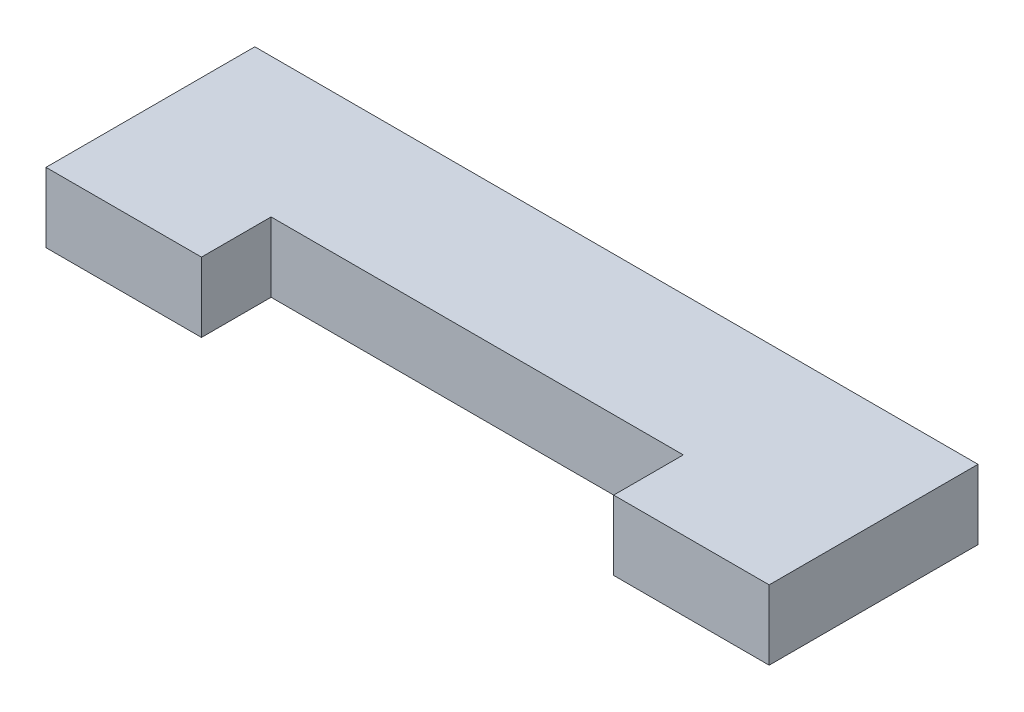
ISO-10303-21;
HEADER;
FILE_DESCRIPTION(('STEP AP214'),'2;1');
FILE_NAME('part.step','',(''),(''),'','','');
FILE_SCHEMA(('AUTOMOTIVE_DESIGN { 1 0 10303 214 1 1 1 1 }'));
ENDSEC;
DATA;
#1=APPLICATION_CONTEXT('core data for automotive mechanical design processes');
#2=APPLICATION_PROTOCOL_DEFINITION('international standard','automotive_design',2000,#1);
#3=PRODUCT_CONTEXT('',#1,'mechanical');
#4=PRODUCT('Part','Part','',(#3));
#5=PRODUCT_RELATED_PRODUCT_CATEGORY('part','',(#4));
#6=PRODUCT_DEFINITION_FORMATION('','',#4);
#7=PRODUCT_DEFINITION_CONTEXT('part definition',#1,'design');
#8=PRODUCT_DEFINITION('design','',#6,#7);
#9=PRODUCT_DEFINITION_SHAPE('','',#8);
#10=(LENGTH_UNIT() NAMED_UNIT(*) SI_UNIT(.MILLI.,.METRE.));
#11=(NAMED_UNIT(*) PLANE_ANGLE_UNIT() SI_UNIT($,.RADIAN.));
#12=(NAMED_UNIT(*) SI_UNIT($,.STERADIAN.) SOLID_ANGLE_UNIT());
#13=UNCERTAINTY_MEASURE_WITH_UNIT(LENGTH_MEASURE(1.E-05),#10,'distance_accuracy_value','');
#14=(GEOMETRIC_REPRESENTATION_CONTEXT(3) GLOBAL_UNCERTAINTY_ASSIGNED_CONTEXT((#13)) GLOBAL_UNIT_ASSIGNED_CONTEXT((#10,
#11,#12)) REPRESENTATION_CONTEXT('',''));
#15=CARTESIAN_POINT('',(0.,0.,0.));
#16=DIRECTION('',(0.,0.,1.));
#17=DIRECTION('',(1.,0.,0.));
#18=AXIS2_PLACEMENT_3D('',#15,#16,#17);
#19=CARTESIAN_POINT('',(-20.,3.85,-3.85));
#20=DIRECTION('',(0.,0.,1.));
#21=DIRECTION('',(1.,0.,0.));
#22=AXIS2_PLACEMENT_3D('',#19,#20,#21);
#23=PLANE('',#22);
#24=DIRECTION('',(-1.,0.,0.));
#25=VECTOR('',#24,1.);
#26=CARTESIAN_POINT('',(-20.,0.,-3.85));
#27=LINE('',#26,#25);
#28=CARTESIAN_POINT('',(20.,0.,-3.85));
#29=VERTEX_POINT('',#28);
#30=CARTESIAN_POINT('',(-20.,0.,-3.85));
#31=VERTEX_POINT('',#30);
#32=EDGE_CURVE('E187',#29,#31,#27,.T.);
#33=ORIENTED_EDGE('',*,*,#32,.T.);
#34=DIRECTION('',(0.,-1.,0.));
#35=VECTOR('',#34,1.);
#36=CARTESIAN_POINT('',(-20.,3.85,-3.85));
#37=LINE('',#36,#35);
#38=CARTESIAN_POINT('',(-20.,3.85,-3.85));
#39=VERTEX_POINT('',#38);
#40=EDGE_CURVE('E46',#39,#31,#37,.T.);
#41=ORIENTED_EDGE('',*,*,#40,.F.);
#42=DIRECTION('',(-1.,0.,0.));
#43=VECTOR('',#42,1.);
#44=CARTESIAN_POINT('',(-20.,3.85,-3.85));
#45=LINE('',#44,#43);
#46=CARTESIAN_POINT('',(20.,3.85,-3.85));
#47=VERTEX_POINT('',#46);
#48=EDGE_CURVE('E98',#47,#39,#45,.T.);
#49=ORIENTED_EDGE('',*,*,#48,.F.);
#50=DIRECTION('',(0.,-1.,0.));
#51=VECTOR('',#50,1.);
#52=CARTESIAN_POINT('',(20.,3.85,-3.85));
#53=LINE('',#52,#51);
#54=EDGE_CURVE('E12',#47,#29,#53,.T.);
#55=ORIENTED_EDGE('',*,*,#54,.T.);
#56=EDGE_LOOP('',(#33,#41,#49,#55));
#57=FACE_BOUND('',#56,.T.);
#58=ADVANCED_FACE('F38',(#57),#23,.F.);
#59=CARTESIAN_POINT('',(-20.,3.85,3.85));
#60=DIRECTION('',(1.,0.,0.));
#61=DIRECTION('',(0.,0.,-1.));
#62=AXIS2_PLACEMENT_3D('',#59,#60,#61);
#63=PLANE('',#62);
#64=DIRECTION('',(0.,0.,1.));
#65=VECTOR('',#64,1.);
#66=CARTESIAN_POINT('',(-20.,0.,3.85));
#67=LINE('',#66,#65);
#68=CARTESIAN_POINT('',(-20.,0.,7.7));
#69=VERTEX_POINT('',#68);
#70=EDGE_CURVE('E185',#31,#69,#67,.T.);
#71=ORIENTED_EDGE('',*,*,#70,.T.);
#72=DIRECTION('',(0.,-1.,0.));
#73=VECTOR('',#72,1.);
#74=CARTESIAN_POINT('',(-20.,3.85,7.7));
#75=LINE('',#74,#73);
#76=CARTESIAN_POINT('',(-20.,3.85,7.7));
#77=VERTEX_POINT('',#76);
#78=EDGE_CURVE('E178',#77,#69,#75,.T.);
#79=ORIENTED_EDGE('',*,*,#78,.F.);
#80=DIRECTION('',(0.,0.,1.));
#81=VECTOR('',#80,1.);
#82=CARTESIAN_POINT('',(-20.,3.85,3.85));
#83=LINE('',#82,#81);
#84=EDGE_CURVE('E154',#39,#77,#83,.T.);
#85=ORIENTED_EDGE('',*,*,#84,.F.);
#86=ORIENTED_EDGE('',*,*,#40,.T.);
#87=EDGE_LOOP('',(#71,#79,#85,#86));
#88=FACE_BOUND('',#87,.T.);
#89=ADVANCED_FACE('F183',(#88),#63,.F.);
#90=CARTESIAN_POINT('',(-20.,3.85,7.7));
#91=DIRECTION('',(0.,0.,-1.));
#92=DIRECTION('',(-1.,0.,0.));
#93=AXIS2_PLACEMENT_3D('',#90,#91,#92);
#94=PLANE('',#93);
#95=DIRECTION('',(1.,0.,0.));
#96=VECTOR('',#95,1.);
#97=CARTESIAN_POINT('',(-20.,0.,7.7));
#98=LINE('',#97,#96);
#99=CARTESIAN_POINT('',(-11.4,0.,7.7));
#100=VERTEX_POINT('',#99);
#101=EDGE_CURVE('E189',#69,#100,#98,.T.);
#102=ORIENTED_EDGE('',*,*,#101,.T.);
#103=DIRECTION('',(0.,-1.,0.));
#104=VECTOR('',#103,1.);
#105=CARTESIAN_POINT('',(-11.4,3.85,7.7));
#106=LINE('',#105,#104);
#107=CARTESIAN_POINT('',(-11.4,3.85,7.7));
#108=VERTEX_POINT('',#107);
#109=EDGE_CURVE('E175',#108,#100,#106,.T.);
#110=ORIENTED_EDGE('',*,*,#109,.F.);
#111=DIRECTION('',(1.,0.,0.));
#112=VECTOR('',#111,1.);
#113=CARTESIAN_POINT('',(-20.,3.85,7.7));
#114=LINE('',#113,#112);
#115=EDGE_CURVE('E150',#77,#108,#114,.T.);
#116=ORIENTED_EDGE('',*,*,#115,.F.);
#117=ORIENTED_EDGE('',*,*,#78,.T.);
#118=EDGE_LOOP('',(#102,#110,#116,#117));
#119=FACE_BOUND('',#118,.T.);
#120=ADVANCED_FACE('F213',(#119),#94,.F.);
#121=CARTESIAN_POINT('',(-11.4,3.85,7.7));
#122=DIRECTION('',(-1.,0.,0.));
#123=DIRECTION('',(0.,0.,1.));
#124=AXIS2_PLACEMENT_3D('',#121,#122,#123);
#125=PLANE('',#124);
#126=DIRECTION('',(0.,0.,-1.));
#127=VECTOR('',#126,1.);
#128=CARTESIAN_POINT('',(-11.4,0.,7.7));
#129=LINE('',#128,#127);
#130=CARTESIAN_POINT('',(-11.4,0.,3.85));
#131=VERTEX_POINT('',#130);
#132=EDGE_CURVE('E193',#100,#131,#129,.T.);
#133=ORIENTED_EDGE('',*,*,#132,.T.);
#134=DIRECTION('',(0.,-1.,0.));
#135=VECTOR('',#134,1.);
#136=CARTESIAN_POINT('',(-11.4,3.85,3.85));
#137=LINE('',#136,#135);
#138=CARTESIAN_POINT('',(-11.4,3.85,3.85));
#139=VERTEX_POINT('',#138);
#140=EDGE_CURVE('E128',#139,#131,#137,.T.);
#141=ORIENTED_EDGE('',*,*,#140,.F.);
#142=DIRECTION('',(0.,0.,-1.));
#143=VECTOR('',#142,1.);
#144=CARTESIAN_POINT('',(-11.4,3.85,7.7));
#145=LINE('',#144,#143);
#146=EDGE_CURVE('E118',#108,#139,#145,.T.);
#147=ORIENTED_EDGE('',*,*,#146,.F.);
#148=ORIENTED_EDGE('',*,*,#109,.T.);
#149=EDGE_LOOP('',(#133,#141,#147,#148));
#150=FACE_BOUND('',#149,.T.);
#151=ADVANCED_FACE('F197',(#150),#125,.F.);
#152=CARTESIAN_POINT('',(-11.4,3.85,3.85));
#153=DIRECTION('',(0.,0.,-1.));
#154=DIRECTION('',(-1.,0.,0.));
#155=AXIS2_PLACEMENT_3D('',#152,#153,#154);
#156=PLANE('',#155);
#157=DIRECTION('',(1.,0.,0.));
#158=VECTOR('',#157,1.);
#159=CARTESIAN_POINT('',(-11.4,0.,3.85));
#160=LINE('',#159,#158);
#161=CARTESIAN_POINT('',(11.4,0.,3.85));
#162=VERTEX_POINT('',#161);
#163=EDGE_CURVE('E127',#131,#162,#160,.T.);
#164=ORIENTED_EDGE('',*,*,#163,.T.);
#165=DIRECTION('',(0.,-1.,0.));
#166=VECTOR('',#165,1.);
#167=CARTESIAN_POINT('',(11.4,3.85,3.85));
#168=LINE('',#167,#166);
#169=CARTESIAN_POINT('',(11.4,3.85,3.85));
#170=VERTEX_POINT('',#169);
#171=EDGE_CURVE('E124',#170,#162,#168,.T.);
#172=ORIENTED_EDGE('',*,*,#171,.F.);
#173=DIRECTION('',(1.,0.,0.));
#174=VECTOR('',#173,1.);
#175=CARTESIAN_POINT('',(-11.4,3.85,3.85));
#176=LINE('',#175,#174);
#177=EDGE_CURVE('E112',#139,#170,#176,.T.);
#178=ORIENTED_EDGE('',*,*,#177,.F.);
#179=ORIENTED_EDGE('',*,*,#140,.T.);
#180=EDGE_LOOP('',(#164,#172,#178,#179));
#181=FACE_BOUND('',#180,.T.);
#182=ADVANCED_FACE('F125',(#181),#156,.F.);
#183=CARTESIAN_POINT('',(11.4,3.85,7.7));
#184=DIRECTION('',(1.,0.,0.));
#185=DIRECTION('',(0.,0.,-1.));
#186=AXIS2_PLACEMENT_3D('',#183,#184,#185);
#187=PLANE('',#186);
#188=DIRECTION('',(0.,0.,1.));
#189=VECTOR('',#188,1.);
#190=CARTESIAN_POINT('',(11.4,0.,7.7));
#191=LINE('',#190,#189);
#192=CARTESIAN_POINT('',(11.4,0.,7.7));
#193=VERTEX_POINT('',#192);
#194=EDGE_CURVE('E84',#162,#193,#191,.T.);
#195=ORIENTED_EDGE('',*,*,#194,.T.);
#196=DIRECTION('',(0.,-1.,0.));
#197=VECTOR('',#196,1.);
#198=CARTESIAN_POINT('',(11.4,3.85,7.7));
#199=LINE('',#198,#197);
#200=CARTESIAN_POINT('',(11.4,3.85,7.7));
#201=VERTEX_POINT('',#200);
#202=EDGE_CURVE('E129',#201,#193,#199,.T.);
#203=ORIENTED_EDGE('',*,*,#202,.F.);
#204=DIRECTION('',(0.,0.,1.));
#205=VECTOR('',#204,1.);
#206=CARTESIAN_POINT('',(11.4,3.85,7.7));
#207=LINE('',#206,#205);
#208=EDGE_CURVE('E116',#170,#201,#207,.T.);
#209=ORIENTED_EDGE('',*,*,#208,.F.);
#210=ORIENTED_EDGE('',*,*,#171,.T.);
#211=EDGE_LOOP('',(#195,#203,#209,#210));
#212=FACE_BOUND('',#211,.T.);
#213=ADVANCED_FACE('F131',(#212),#187,.F.);
#214=CARTESIAN_POINT('',(20.,3.85,7.7));
#215=DIRECTION('',(0.,0.,-1.));
#216=DIRECTION('',(-1.,0.,0.));
#217=AXIS2_PLACEMENT_3D('',#214,#215,#216);
#218=PLANE('',#217);
#219=DIRECTION('',(1.,0.,0.));
#220=VECTOR('',#219,1.);
#221=CARTESIAN_POINT('',(20.,0.,7.7));
#222=LINE('',#221,#220);
#223=CARTESIAN_POINT('',(20.,0.,7.7));
#224=VERTEX_POINT('',#223);
#225=EDGE_CURVE('E91',#193,#224,#222,.T.);
#226=ORIENTED_EDGE('',*,*,#225,.T.);
#227=DIRECTION('',(0.,-1.,0.));
#228=VECTOR('',#227,1.);
#229=CARTESIAN_POINT('',(20.,3.85,7.7));
#230=LINE('',#229,#228);
#231=CARTESIAN_POINT('',(20.,3.85,7.7));
#232=VERTEX_POINT('',#231);
#233=EDGE_CURVE('E137',#232,#224,#230,.T.);
#234=ORIENTED_EDGE('',*,*,#233,.F.);
#235=DIRECTION('',(1.,0.,0.));
#236=VECTOR('',#235,1.);
#237=CARTESIAN_POINT('',(20.,3.85,7.7));
#238=LINE('',#237,#236);
#239=EDGE_CURVE('E134',#201,#232,#238,.T.);
#240=ORIENTED_EDGE('',*,*,#239,.F.);
#241=ORIENTED_EDGE('',*,*,#202,.T.);
#242=EDGE_LOOP('',(#226,#234,#240,#241));
#243=FACE_BOUND('',#242,.T.);
#244=ADVANCED_FACE('F226',(#243),#218,.F.);
#245=CARTESIAN_POINT('',(20.,3.85,3.85));
#246=DIRECTION('',(-1.,0.,0.));
#247=DIRECTION('',(0.,0.,1.));
#248=AXIS2_PLACEMENT_3D('',#245,#246,#247);
#249=PLANE('',#248);
#250=DIRECTION('',(0.,0.,-1.));
#251=VECTOR('',#250,1.);
#252=CARTESIAN_POINT('',(20.,0.,3.85));
#253=LINE('',#252,#251);
#254=EDGE_CURVE('E164',#224,#29,#253,.T.);
#255=ORIENTED_EDGE('',*,*,#254,.T.);
#256=ORIENTED_EDGE('',*,*,#54,.F.);
#257=DIRECTION('',(0.,0.,-1.));
#258=VECTOR('',#257,1.);
#259=CARTESIAN_POINT('',(20.,3.85,3.85));
#260=LINE('',#259,#258);
#261=EDGE_CURVE('E54',#232,#47,#260,.T.);
#262=ORIENTED_EDGE('',*,*,#261,.F.);
#263=ORIENTED_EDGE('',*,*,#233,.T.);
#264=EDGE_LOOP('',(#255,#256,#262,#263));
#265=FACE_BOUND('',#264,.T.);
#266=ADVANCED_FACE('F206',(#265),#249,.F.);
#267=CARTESIAN_POINT('',(0.,3.85,0.));
#268=DIRECTION('',(0.,-1.,0.));
#269=DIRECTION('',(0.,0.,-1.));
#270=AXIS2_PLACEMENT_3D('',#267,#268,#269);
#271=PLANE('',#270);
#272=ORIENTED_EDGE('',*,*,#261,.T.);
#273=ORIENTED_EDGE('',*,*,#48,.T.);
#274=ORIENTED_EDGE('',*,*,#84,.T.);
#275=ORIENTED_EDGE('',*,*,#115,.T.);
#276=ORIENTED_EDGE('',*,*,#146,.T.);
#277=ORIENTED_EDGE('',*,*,#177,.T.);
#278=ORIENTED_EDGE('',*,*,#208,.T.);
#279=ORIENTED_EDGE('',*,*,#239,.T.);
#280=EDGE_LOOP('',(#272,#273,#274,#275,#276,#277,#278,#279));
#281=FACE_BOUND('',#280,.T.);
#282=ADVANCED_FACE('F114',(#281),#271,.F.);
#283=CARTESIAN_POINT('',(0.,0.,0.));
#284=DIRECTION('',(0.,-1.,0.));
#285=DIRECTION('',(0.,0.,-1.));
#286=AXIS2_PLACEMENT_3D('',#283,#284,#285);
#287=PLANE('',#286);
#288=ORIENTED_EDGE('',*,*,#32,.F.);
#289=ORIENTED_EDGE('',*,*,#254,.F.);
#290=ORIENTED_EDGE('',*,*,#225,.F.);
#291=ORIENTED_EDGE('',*,*,#194,.F.);
#292=ORIENTED_EDGE('',*,*,#163,.F.);
#293=ORIENTED_EDGE('',*,*,#132,.F.);
#294=ORIENTED_EDGE('',*,*,#101,.F.);
#295=ORIENTED_EDGE('',*,*,#70,.F.);
#296=EDGE_LOOP('',(#288,#289,#290,#291,#292,#293,#294,#295));
#297=FACE_BOUND('',#296,.T.);
#298=ADVANCED_FACE('F200',(#297),#287,.T.);
#299=CLOSED_SHELL('',(#58,#89,#120,#151,#182,#213,#244,#266,#282,#298));
#300=MANIFOLD_SOLID_BREP('B2',#299);
#301=ADVANCED_BREP_SHAPE_REPRESENTATION('',(#18,#300),#14);
#302=SHAPE_DEFINITION_REPRESENTATION(#9,#301);
ENDSEC;
END-ISO-10303-21;
